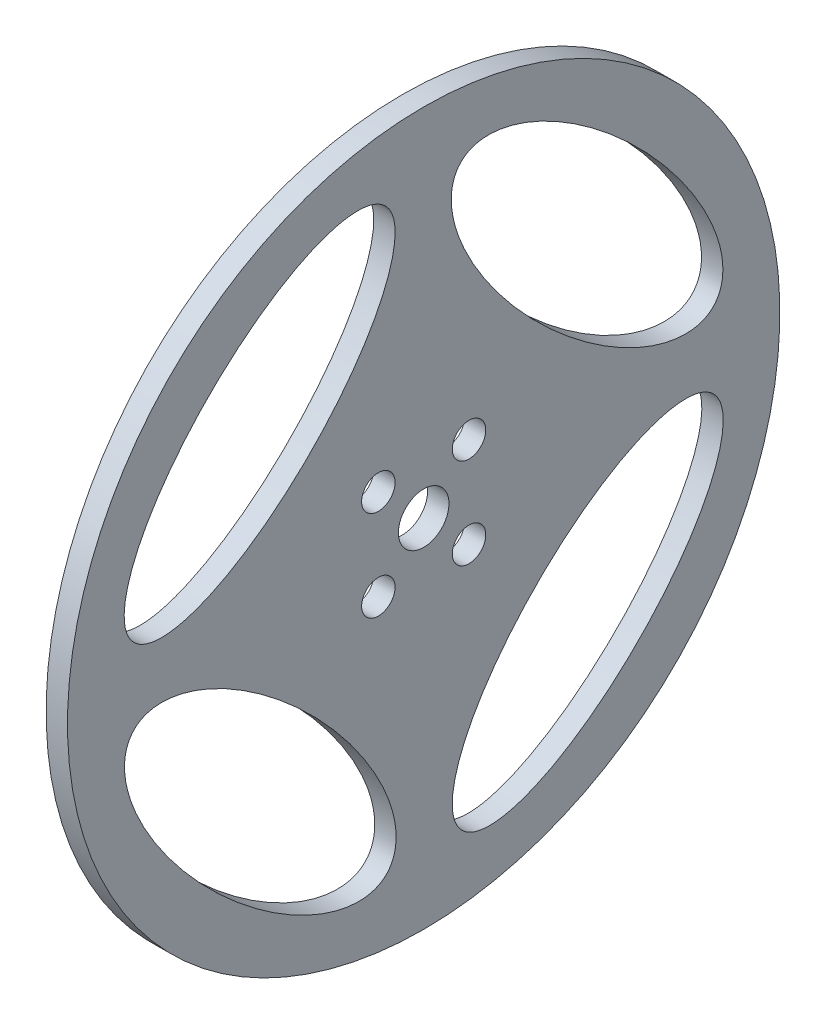
ISO-10303-21;
HEADER;
FILE_DESCRIPTION(('STEP AP214'),'2;1');
FILE_NAME('part.step','',(''),(''),'','','');
FILE_SCHEMA(('AUTOMOTIVE_DESIGN { 1 0 10303 214 1 1 1 1 }'));
ENDSEC;
DATA;
#1=APPLICATION_CONTEXT('core data for automotive mechanical design processes');
#2=APPLICATION_PROTOCOL_DEFINITION('international standard','automotive_design',2000,#1);
#3=PRODUCT_CONTEXT('',#1,'mechanical');
#4=PRODUCT('Part','Part','',(#3));
#5=PRODUCT_RELATED_PRODUCT_CATEGORY('part','',(#4));
#6=PRODUCT_DEFINITION_FORMATION('','',#4);
#7=PRODUCT_DEFINITION_CONTEXT('part definition',#1,'design');
#8=PRODUCT_DEFINITION('design','',#6,#7);
#9=PRODUCT_DEFINITION_SHAPE('','',#8);
#10=(LENGTH_UNIT() NAMED_UNIT(*) SI_UNIT(.MILLI.,.METRE.));
#11=(NAMED_UNIT(*) PLANE_ANGLE_UNIT() SI_UNIT($,.RADIAN.));
#12=(NAMED_UNIT(*) SI_UNIT($,.STERADIAN.) SOLID_ANGLE_UNIT());
#13=UNCERTAINTY_MEASURE_WITH_UNIT(LENGTH_MEASURE(1.E-05),#10,'distance_accuracy_value','');
#14=(GEOMETRIC_REPRESENTATION_CONTEXT(3) GLOBAL_UNCERTAINTY_ASSIGNED_CONTEXT((#13)) GLOBAL_UNIT_ASSIGNED_CONTEXT((#10,
#11,#12)) REPRESENTATION_CONTEXT('',''));
#15=CARTESIAN_POINT('',(0.,0.,0.));
#16=DIRECTION('',(0.,0.,1.));
#17=DIRECTION('',(1.,0.,0.));
#18=AXIS2_PLACEMENT_3D('',#15,#16,#17);
#19=CARTESIAN_POINT('',(-41.0533728527879,13.3000000000001,0.));
#20=DIRECTION('',(-1.,0.,0.));
#21=DIRECTION('',(0.,-1.,0.));
#22=AXIS2_PLACEMENT_3D('',#19,#20,#21);
#23=PLANE('',#22);
#24=CARTESIAN_POINT('',(-41.0533728527879,32.7773295973494,-22.9345155078859));
#25=DIRECTION('',(1.,0.,0.));
#26=DIRECTION('',(0.,-0.705987654506574,-0.708224139439139));
#27=AXIS2_PLACEMENT_3D('',#24,#25,#26);
#28=ELLIPSE('',#27,25.,10.);
#29=CARTESIAN_POINT('',(-41.0533728527879,15.1276382346851,-40.6401189938644));
#30=VERTEX_POINT('',#29);
#31=EDGE_CURVE('E166',#30,#30,#28,.T.);
#32=ORIENTED_EDGE('',*,*,#31,.T.);
#33=EDGE_LOOP('',(#32));
#34=FACE_BOUND('',#33,.T.);
#35=CARTESIAN_POINT('',(-41.053372852788,-13.1845155078862,-23.0273295973492));
#36=DIRECTION('',(1.,0.,0.));
#37=DIRECTION('',(0.,-0.708224139439132,0.705987654506581));
#38=AXIS2_PLACEMENT_3D('',#35,#36,#37);
#39=ELLIPSE('',#38,25.,10.);
#40=CARTESIAN_POINT('',(-41.053372852788,-30.8901189938645,-5.37763823468466));
#41=VERTEX_POINT('',#40);
#42=EDGE_CURVE('E170',#41,#41,#39,.T.);
#43=ORIENTED_EDGE('',*,*,#42,.T.);
#44=EDGE_LOOP('',(#43));
#45=FACE_BOUND('',#44,.T.);
#46=CARTESIAN_POINT('',(-41.053372852788,-13.2773295973492,22.9345155078861));
#47=DIRECTION('',(1.,0.,0.));
#48=DIRECTION('',(0.,0.705987654506578,0.708224139439134));
#49=AXIS2_PLACEMENT_3D('',#46,#47,#48);
#50=ELLIPSE('',#49,25.,10.);
#51=CARTESIAN_POINT('',(-41.053372852788,4.37236176531523,40.6401189938644));
#52=VERTEX_POINT('',#51);
#53=EDGE_CURVE('E120',#52,#52,#50,.T.);
#54=ORIENTED_EDGE('',*,*,#53,.T.);
#55=EDGE_LOOP('',(#54));
#56=FACE_BOUND('',#55,.T.);
#57=CARTESIAN_POINT('',(-41.0533728527879,32.6845155078863,23.0273295973492));
#58=DIRECTION('',(1.,0.,0.));
#59=DIRECTION('',(0.,0.708224139439132,-0.705987654506581));
#60=AXIS2_PLACEMENT_3D('',#57,#58,#59);
#61=ELLIPSE('',#60,25.,10.);
#62=CARTESIAN_POINT('',(-41.0533728527879,50.3901189938646,5.37763823468466));
#63=VERTEX_POINT('',#62);
#64=EDGE_CURVE('E111',#63,#63,#61,.T.);
#65=ORIENTED_EDGE('',*,*,#64,.T.);
#66=EDGE_LOOP('',(#65));
#67=FACE_BOUND('',#66,.T.);
#68=CARTESIAN_POINT('',(-41.0533728527879,3.3860389693211,6.36396103067892));
#69=DIRECTION('',(-1.,0.,0.));
#70=DIRECTION('',(0.,0.,1.));
#71=AXIS2_PLACEMENT_3D('',#68,#69,#70);
#72=CIRCLE('',#71,2.35);
#73=CARTESIAN_POINT('',(-41.0533728527879,3.3860389693211,8.71396103067892));
#74=VERTEX_POINT('',#73);
#75=EDGE_CURVE('E106',#74,#74,#72,.T.);
#76=ORIENTED_EDGE('',*,*,#75,.F.);
#77=EDGE_LOOP('',(#76));
#78=FACE_BOUND('',#77,.T.);
#79=CARTESIAN_POINT('',(-41.0533728527879,3.38603896932113,-6.36396103067897));
#80=DIRECTION('',(-1.,0.,0.));
#81=DIRECTION('',(0.,0.,1.));
#82=AXIS2_PLACEMENT_3D('',#79,#80,#81);
#83=CIRCLE('',#82,2.35);
#84=CARTESIAN_POINT('',(-41.0533728527879,3.38603896932113,-4.01396103067897));
#85=VERTEX_POINT('',#84);
#86=EDGE_CURVE('E98',#85,#85,#83,.T.);
#87=ORIENTED_EDGE('',*,*,#86,.F.);
#88=EDGE_LOOP('',(#87));
#89=FACE_BOUND('',#88,.T.);
#90=CARTESIAN_POINT('',(-41.0533728527879,16.113961030679,-6.36396103067897));
#91=DIRECTION('',(-1.,0.,0.));
#92=DIRECTION('',(0.,0.,1.));
#93=AXIS2_PLACEMENT_3D('',#90,#91,#92);
#94=CIRCLE('',#93,2.35);
#95=CARTESIAN_POINT('',(-41.0533728527879,16.113961030679,-4.01396103067897));
#96=VERTEX_POINT('',#95);
#97=EDGE_CURVE('E92',#96,#96,#94,.T.);
#98=ORIENTED_EDGE('',*,*,#97,.F.);
#99=EDGE_LOOP('',(#98));
#100=FACE_BOUND('',#99,.T.);
#101=CARTESIAN_POINT('',(-41.0533728527879,16.113961030679,6.36396103067892));
#102=DIRECTION('',(-1.,0.,0.));
#103=DIRECTION('',(0.,0.,1.));
#104=AXIS2_PLACEMENT_3D('',#101,#102,#103);
#105=CIRCLE('',#104,2.35);
#106=CARTESIAN_POINT('',(-41.0533728527879,16.113961030679,8.71396103067891));
#107=VERTEX_POINT('',#106);
#108=EDGE_CURVE('E84',#107,#107,#105,.T.);
#109=ORIENTED_EDGE('',*,*,#108,.F.);
#110=EDGE_LOOP('',(#109));
#111=FACE_BOUND('',#110,.T.);
#112=CARTESIAN_POINT('',(-41.0533728527879,9.75000000000004,0.));
#113=DIRECTION('',(1.,0.,0.));
#114=DIRECTION('',(0.,1.,0.));
#115=AXIS2_PLACEMENT_3D('',#112,#113,#114);
#116=CIRCLE('',#115,3.55);
#117=CARTESIAN_POINT('',(-41.0533728527879,13.3,0.));
#118=VERTEX_POINT('',#117);
#119=EDGE_CURVE('E12',#118,#118,#116,.T.);
#120=ORIENTED_EDGE('',*,*,#119,.T.);
#121=EDGE_LOOP('',(#120));
#122=FACE_BOUND('',#121,.T.);
#123=CARTESIAN_POINT('',(-41.0533728527879,9.75000000000004,0.));
#124=DIRECTION('',(1.,0.,0.));
#125=DIRECTION('',(0.,1.,0.));
#126=AXIS2_PLACEMENT_3D('',#123,#124,#125);
#127=CIRCLE('',#126,50.);
#128=CARTESIAN_POINT('',(-41.0533728527879,59.7500000000001,0.));
#129=VERTEX_POINT('',#128);
#130=EDGE_CURVE('E75',#129,#129,#127,.T.);
#131=ORIENTED_EDGE('',*,*,#130,.F.);
#132=EDGE_LOOP('',(#131));
#133=FACE_BOUND('',#132,.T.);
#134=ADVANCED_FACE('F54',(#34,#45,#56,#67,#78,#89,#100,#111,#122,#133),#23,.T.);
#135=CARTESIAN_POINT('',(-17.6629112004517,9.75000000000004,0.));
#136=DIRECTION('',(1.,0.,0.));
#137=DIRECTION('',(0.,1.,0.));
#138=AXIS2_PLACEMENT_3D('',#135,#136,#137);
#139=CYLINDRICAL_SURFACE('',#138,3.55);
#140=CARTESIAN_POINT('',(-38.0533728527879,9.75000000000004,0.));
#141=DIRECTION('',(1.,0.,0.));
#142=DIRECTION('',(0.,1.,0.));
#143=AXIS2_PLACEMENT_3D('',#140,#141,#142);
#144=CIRCLE('',#143,3.55);
#145=CARTESIAN_POINT('',(-38.0533728527879,13.3,0.));
#146=VERTEX_POINT('',#145);
#147=EDGE_CURVE('E61',#146,#146,#144,.T.);
#148=ORIENTED_EDGE('',*,*,#147,.T.);
#149=EDGE_LOOP('',(#148));
#150=FACE_BOUND('',#149,.T.);
#151=ORIENTED_EDGE('',*,*,#119,.F.);
#152=EDGE_LOOP('',(#151));
#153=FACE_BOUND('',#152,.T.);
#154=ADVANCED_FACE('F153',(#150,#153),#139,.F.);
#155=CARTESIAN_POINT('',(-38.0533728527879,13.3,0.));
#156=DIRECTION('',(1.,0.,0.));
#157=DIRECTION('',(0.,1.,0.));
#158=AXIS2_PLACEMENT_3D('',#155,#156,#157);
#159=PLANE('',#158);
#160=CARTESIAN_POINT('',(-38.0533728527879,32.7773295973494,-22.9345155078859));
#161=DIRECTION('',(1.,0.,0.));
#162=DIRECTION('',(0.,-0.705987654506574,-0.708224139439139));
#163=AXIS2_PLACEMENT_3D('',#160,#161,#162);
#164=ELLIPSE('',#163,25.,10.);
#165=CARTESIAN_POINT('',(-38.0533728527879,15.1276382346851,-40.6401189938644));
#166=VERTEX_POINT('',#165);
#167=EDGE_CURVE('E216',#166,#166,#164,.T.);
#168=ORIENTED_EDGE('',*,*,#167,.F.);
#169=EDGE_LOOP('',(#168));
#170=FACE_BOUND('',#169,.T.);
#171=CARTESIAN_POINT('',(-38.053372852788,-13.1845155078862,-23.0273295973492));
#172=DIRECTION('',(1.,0.,0.));
#173=DIRECTION('',(0.,-0.708224139439132,0.705987654506581));
#174=AXIS2_PLACEMENT_3D('',#171,#172,#173);
#175=ELLIPSE('',#174,25.,10.);
#176=CARTESIAN_POINT('',(-38.053372852788,-30.8901189938645,-5.37763823468466));
#177=VERTEX_POINT('',#176);
#178=EDGE_CURVE('E206',#177,#177,#175,.T.);
#179=ORIENTED_EDGE('',*,*,#178,.F.);
#180=EDGE_LOOP('',(#179));
#181=FACE_BOUND('',#180,.T.);
#182=CARTESIAN_POINT('',(-38.053372852788,-13.2773295973493,22.9345155078861));
#183=DIRECTION('',(1.,0.,0.));
#184=DIRECTION('',(0.,0.705987654506578,0.708224139439134));
#185=AXIS2_PLACEMENT_3D('',#182,#183,#184);
#186=ELLIPSE('',#185,25.,10.);
#187=CARTESIAN_POINT('',(-38.053372852788,4.37236176531517,40.6401189938644));
#188=VERTEX_POINT('',#187);
#189=EDGE_CURVE('E115',#188,#188,#186,.T.);
#190=ORIENTED_EDGE('',*,*,#189,.F.);
#191=EDGE_LOOP('',(#190));
#192=FACE_BOUND('',#191,.T.);
#193=CARTESIAN_POINT('',(-38.0533728527879,32.6845155078862,23.0273295973492));
#194=DIRECTION('',(1.,0.,0.));
#195=DIRECTION('',(0.,0.708224139439132,-0.705987654506581));
#196=AXIS2_PLACEMENT_3D('',#193,#194,#195);
#197=ELLIPSE('',#196,25.,10.);
#198=CARTESIAN_POINT('',(-38.0533728527879,50.3901189938645,5.37763823468468));
#199=VERTEX_POINT('',#198);
#200=EDGE_CURVE('E110',#199,#199,#197,.T.);
#201=ORIENTED_EDGE('',*,*,#200,.F.);
#202=EDGE_LOOP('',(#201));
#203=FACE_BOUND('',#202,.T.);
#204=CARTESIAN_POINT('',(-38.053372852788,3.3860389693211,6.36396103067892));
#205=DIRECTION('',(-1.,0.,0.));
#206=DIRECTION('',(0.,0.,1.));
#207=AXIS2_PLACEMENT_3D('',#204,#205,#206);
#208=CIRCLE('',#207,2.35);
#209=CARTESIAN_POINT('',(-38.053372852788,3.3860389693211,8.71396103067892));
#210=VERTEX_POINT('',#209);
#211=EDGE_CURVE('E102',#210,#210,#208,.T.);
#212=ORIENTED_EDGE('',*,*,#211,.T.);
#213=EDGE_LOOP('',(#212));
#214=FACE_BOUND('',#213,.T.);
#215=CARTESIAN_POINT('',(-38.053372852788,3.38603896932113,-6.36396103067897));
#216=DIRECTION('',(-1.,0.,0.));
#217=DIRECTION('',(0.,0.,1.));
#218=AXIS2_PLACEMENT_3D('',#215,#216,#217);
#219=CIRCLE('',#218,2.35);
#220=CARTESIAN_POINT('',(-38.053372852788,3.38603896932113,-4.01396103067897));
#221=VERTEX_POINT('',#220);
#222=EDGE_CURVE('E95',#221,#221,#219,.T.);
#223=ORIENTED_EDGE('',*,*,#222,.T.);
#224=EDGE_LOOP('',(#223));
#225=FACE_BOUND('',#224,.T.);
#226=CARTESIAN_POINT('',(-38.0533728527879,16.113961030679,-6.36396103067897));
#227=DIRECTION('',(-1.,0.,0.));
#228=DIRECTION('',(0.,0.,1.));
#229=AXIS2_PLACEMENT_3D('',#226,#227,#228);
#230=CIRCLE('',#229,2.35);
#231=CARTESIAN_POINT('',(-38.0533728527879,16.113961030679,-4.01396103067898));
#232=VERTEX_POINT('',#231);
#233=EDGE_CURVE('E88',#232,#232,#230,.T.);
#234=ORIENTED_EDGE('',*,*,#233,.T.);
#235=EDGE_LOOP('',(#234));
#236=FACE_BOUND('',#235,.T.);
#237=CARTESIAN_POINT('',(-38.0533728527879,16.113961030679,6.36396103067892));
#238=DIRECTION('',(-1.,0.,0.));
#239=DIRECTION('',(0.,0.,1.));
#240=AXIS2_PLACEMENT_3D('',#237,#238,#239);
#241=CIRCLE('',#240,2.35);
#242=CARTESIAN_POINT('',(-38.0533728527879,16.113961030679,8.71396103067891));
#243=VERTEX_POINT('',#242);
#244=EDGE_CURVE('E81',#243,#243,#241,.T.);
#245=ORIENTED_EDGE('',*,*,#244,.T.);
#246=EDGE_LOOP('',(#245));
#247=FACE_BOUND('',#246,.T.);
#248=CARTESIAN_POINT('',(-38.0533728527879,9.75000000000004,0.));
#249=DIRECTION('',(1.,0.,0.));
#250=DIRECTION('',(0.,1.,0.));
#251=AXIS2_PLACEMENT_3D('',#248,#249,#250);
#252=CIRCLE('',#251,50.);
#253=CARTESIAN_POINT('',(-38.0533728527879,59.7500000000001,0.));
#254=VERTEX_POINT('',#253);
#255=EDGE_CURVE('E68',#254,#254,#252,.T.);
#256=ORIENTED_EDGE('',*,*,#255,.T.);
#257=EDGE_LOOP('',(#256));
#258=FACE_BOUND('',#257,.T.);
#259=ORIENTED_EDGE('',*,*,#147,.F.);
#260=EDGE_LOOP('',(#259));
#261=FACE_BOUND('',#260,.T.);
#262=ADVANCED_FACE('F150',(#170,#181,#192,#203,#214,#225,#236,#247,#258,#261),#159,.T.);
#263=CARTESIAN_POINT('',(-17.6629112004517,9.75000000000004,0.));
#264=DIRECTION('',(1.,0.,0.));
#265=DIRECTION('',(0.,1.,0.));
#266=AXIS2_PLACEMENT_3D('',#263,#264,#265);
#267=CYLINDRICAL_SURFACE('',#266,50.);
#268=ORIENTED_EDGE('',*,*,#130,.T.);
#269=EDGE_LOOP('',(#268));
#270=FACE_BOUND('',#269,.T.);
#271=ORIENTED_EDGE('',*,*,#255,.F.);
#272=EDGE_LOOP('',(#271));
#273=FACE_BOUND('',#272,.T.);
#274=ADVANCED_FACE('F146',(#270,#273),#267,.T.);
#275=CARTESIAN_POINT('',(-41.0533728527879,16.113961030679,6.36396103067892));
#276=DIRECTION('',(-1.,0.,0.));
#277=DIRECTION('',(0.,0.,1.));
#278=AXIS2_PLACEMENT_3D('',#275,#276,#277);
#279=CYLINDRICAL_SURFACE('',#278,2.35);
#280=ORIENTED_EDGE('',*,*,#244,.F.);
#281=EDGE_LOOP('',(#280));
#282=FACE_BOUND('',#281,.T.);
#283=ORIENTED_EDGE('',*,*,#108,.T.);
#284=EDGE_LOOP('',(#283));
#285=FACE_BOUND('',#284,.T.);
#286=ADVANCED_FACE('F142',(#282,#285),#279,.F.);
#287=CARTESIAN_POINT('',(-41.0533728527879,16.113961030679,-6.36396103067897));
#288=DIRECTION('',(-1.,0.,0.));
#289=DIRECTION('',(0.,0.,1.));
#290=AXIS2_PLACEMENT_3D('',#287,#288,#289);
#291=CYLINDRICAL_SURFACE('',#290,2.35);
#292=ORIENTED_EDGE('',*,*,#233,.F.);
#293=EDGE_LOOP('',(#292));
#294=FACE_BOUND('',#293,.T.);
#295=ORIENTED_EDGE('',*,*,#97,.T.);
#296=EDGE_LOOP('',(#295));
#297=FACE_BOUND('',#296,.T.);
#298=ADVANCED_FACE('F138',(#294,#297),#291,.F.);
#299=CARTESIAN_POINT('',(-41.0533728527879,3.38603896932113,-6.36396103067897));
#300=DIRECTION('',(-1.,0.,0.));
#301=DIRECTION('',(0.,0.,1.));
#302=AXIS2_PLACEMENT_3D('',#299,#300,#301);
#303=CYLINDRICAL_SURFACE('',#302,2.35);
#304=ORIENTED_EDGE('',*,*,#222,.F.);
#305=EDGE_LOOP('',(#304));
#306=FACE_BOUND('',#305,.T.);
#307=ORIENTED_EDGE('',*,*,#86,.T.);
#308=EDGE_LOOP('',(#307));
#309=FACE_BOUND('',#308,.T.);
#310=ADVANCED_FACE('F134',(#306,#309),#303,.F.);
#311=CARTESIAN_POINT('',(-41.0533728527879,3.3860389693211,6.36396103067892));
#312=DIRECTION('',(-1.,0.,0.));
#313=DIRECTION('',(0.,0.,1.));
#314=AXIS2_PLACEMENT_3D('',#311,#312,#313);
#315=CYLINDRICAL_SURFACE('',#314,2.35);
#316=ORIENTED_EDGE('',*,*,#211,.F.);
#317=EDGE_LOOP('',(#316));
#318=FACE_BOUND('',#317,.T.);
#319=ORIENTED_EDGE('',*,*,#75,.T.);
#320=EDGE_LOOP('',(#319));
#321=FACE_BOUND('',#320,.T.);
#322=ADVANCED_FACE('F128',(#318,#321),#315,.F.);
#323=CARTESIAN_POINT('',(-41.0543728527879,32.6845155078863,23.0273295973492));
#324=DIRECTION('',(1.,0.,0.));
#325=DIRECTION('',(0.,0.708224139439132,-0.705987654506581));
#326=AXIS2_PLACEMENT_3D('',#323,#324,#325);
#327=ELLIPSE('',#326,25.,10.);
#328=DIRECTION('',(1.,0.,0.));
#329=VECTOR('',#328,1.);
#330=SURFACE_OF_LINEAR_EXTRUSION('',#327,#329);
#331=ORIENTED_EDGE('',*,*,#64,.F.);
#332=EDGE_LOOP('',(#331));
#333=FACE_BOUND('',#332,.T.);
#334=ORIENTED_EDGE('',*,*,#200,.T.);
#335=EDGE_LOOP('',(#334));
#336=FACE_BOUND('',#335,.T.);
#337=ADVANCED_FACE('F123',(#333,#336),#330,.F.);
#338=CARTESIAN_POINT('',(-41.054372852788,-13.2773295973492,22.9345155078861));
#339=DIRECTION('',(1.,0.,0.));
#340=DIRECTION('',(0.,0.705987654506578,0.708224139439134));
#341=AXIS2_PLACEMENT_3D('',#338,#339,#340);
#342=ELLIPSE('',#341,25.,10.);
#343=DIRECTION('',(1.,0.,0.));
#344=VECTOR('',#343,1.);
#345=SURFACE_OF_LINEAR_EXTRUSION('',#342,#344);
#346=ORIENTED_EDGE('',*,*,#53,.F.);
#347=EDGE_LOOP('',(#346));
#348=FACE_BOUND('',#347,.T.);
#349=ORIENTED_EDGE('',*,*,#189,.T.);
#350=EDGE_LOOP('',(#349));
#351=FACE_BOUND('',#350,.T.);
#352=ADVANCED_FACE('F127',(#348,#351),#345,.F.);
#353=CARTESIAN_POINT('',(-41.0543728527881,-13.1845155078862,-23.0273295973492));
#354=DIRECTION('',(1.,0.,0.));
#355=DIRECTION('',(0.,-0.708224139439132,0.705987654506581));
#356=AXIS2_PLACEMENT_3D('',#353,#354,#355);
#357=ELLIPSE('',#356,25.,10.);
#358=DIRECTION('',(1.,0.,0.));
#359=VECTOR('',#358,1.);
#360=SURFACE_OF_LINEAR_EXTRUSION('',#357,#359);
#361=ORIENTED_EDGE('',*,*,#42,.F.);
#362=EDGE_LOOP('',(#361));
#363=FACE_BOUND('',#362,.T.);
#364=ORIENTED_EDGE('',*,*,#178,.T.);
#365=EDGE_LOOP('',(#364));
#366=FACE_BOUND('',#365,.T.);
#367=ADVANCED_FACE('F223',(#363,#366),#360,.F.);
#368=CARTESIAN_POINT('',(-41.054372852788,32.7773295973494,-22.9345155078859));
#369=DIRECTION('',(1.,0.,0.));
#370=DIRECTION('',(0.,-0.705987654506574,-0.708224139439139));
#371=AXIS2_PLACEMENT_3D('',#368,#369,#370);
#372=ELLIPSE('',#371,25.,10.);
#373=DIRECTION('',(1.,0.,0.));
#374=VECTOR('',#373,1.);
#375=SURFACE_OF_LINEAR_EXTRUSION('',#372,#374);
#376=ORIENTED_EDGE('',*,*,#31,.F.);
#377=EDGE_LOOP('',(#376));
#378=FACE_BOUND('',#377,.T.);
#379=ORIENTED_EDGE('',*,*,#167,.T.);
#380=EDGE_LOOP('',(#379));
#381=FACE_BOUND('',#380,.T.);
#382=ADVANCED_FACE('F226',(#378,#381),#375,.F.);
#383=CLOSED_SHELL('',(#134,#154,#262,#274,#286,#298,#310,#322,#337,#352,#367,#382));
#384=MANIFOLD_SOLID_BREP('B2',#383);
#385=ADVANCED_BREP_SHAPE_REPRESENTATION('',(#18,#384),#14);
#386=SHAPE_DEFINITION_REPRESENTATION(#9,#385);
ENDSEC;
END-ISO-10303-21;
